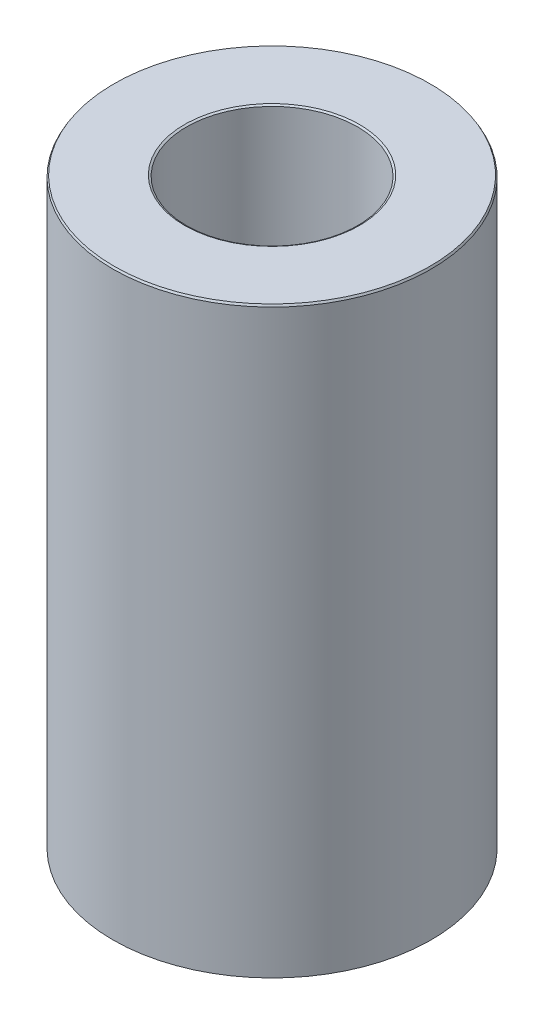
ISO-10303-21;
HEADER;
FILE_DESCRIPTION(('STEP AP214'),'2;1');
FILE_NAME('part.step','',(''),(''),'','','');
FILE_SCHEMA(('AUTOMOTIVE_DESIGN { 1 0 10303 214 1 1 1 1 }'));
ENDSEC;
DATA;
#1=APPLICATION_CONTEXT('core data for automotive mechanical design processes');
#2=APPLICATION_PROTOCOL_DEFINITION('international standard','automotive_design',2000,#1);
#3=PRODUCT_CONTEXT('',#1,'mechanical');
#4=PRODUCT('Part','Part','',(#3));
#5=PRODUCT_RELATED_PRODUCT_CATEGORY('part','',(#4));
#6=PRODUCT_DEFINITION_FORMATION('','',#4);
#7=PRODUCT_DEFINITION_CONTEXT('part definition',#1,'design');
#8=PRODUCT_DEFINITION('design','',#6,#7);
#9=PRODUCT_DEFINITION_SHAPE('','',#8);
#10=(LENGTH_UNIT() NAMED_UNIT(*) SI_UNIT(.MILLI.,.METRE.));
#11=(NAMED_UNIT(*) PLANE_ANGLE_UNIT() SI_UNIT($,.RADIAN.));
#12=(NAMED_UNIT(*) SI_UNIT($,.STERADIAN.) SOLID_ANGLE_UNIT());
#13=UNCERTAINTY_MEASURE_WITH_UNIT(LENGTH_MEASURE(1.E-05),#10,'distance_accuracy_value','');
#14=(GEOMETRIC_REPRESENTATION_CONTEXT(3) GLOBAL_UNCERTAINTY_ASSIGNED_CONTEXT((#13)) GLOBAL_UNIT_ASSIGNED_CONTEXT((#10,
#11,#12)) REPRESENTATION_CONTEXT('',''));
#15=CARTESIAN_POINT('',(0.,0.,0.));
#16=DIRECTION('',(0.,0.,1.));
#17=DIRECTION('',(1.,0.,0.));
#18=AXIS2_PLACEMENT_3D('',#15,#16,#17);
#19=CARTESIAN_POINT('',(0.,192.65912869605,0.));
#20=DIRECTION('',(0.,-1.,0.));
#21=DIRECTION('',(0.,0.,-1.));
#22=AXIS2_PLACEMENT_3D('',#19,#20,#21);
#23=CYLINDRICAL_SURFACE('',#22,52.5);
#24=CARTESIAN_POINT('',(0.,0.365443139363902,0.));
#25=DIRECTION('',(0.,1.,0.));
#26=DIRECTION('',(0.,0.,1.));
#27=AXIS2_PLACEMENT_3D('',#24,#25,#26);
#28=CIRCLE('',#27,52.5);
#29=CARTESIAN_POINT('',(0.,0.365443139363902,52.5));
#30=VERTEX_POINT('',#29);
#31=EDGE_CURVE('E10',#30,#30,#28,.T.);
#32=ORIENTED_EDGE('',*,*,#31,.T.);
#33=EDGE_LOOP('',(#32));
#34=FACE_BOUND('',#33,.T.);
#35=CARTESIAN_POINT('',(0.,192.026162611394,0.));
#36=DIRECTION('',(0.,1.,0.));
#37=DIRECTION('',(0.,0.,1.));
#38=AXIS2_PLACEMENT_3D('',#35,#36,#37);
#39=CIRCLE('',#38,52.5);
#40=CARTESIAN_POINT('',(0.,192.026162611394,52.5));
#41=VERTEX_POINT('',#40);
#42=EDGE_CURVE('E50',#41,#41,#39,.F.);
#43=ORIENTED_EDGE('',*,*,#42,.T.);
#44=EDGE_LOOP('',(#43));
#45=FACE_BOUND('',#44,.T.);
#46=ADVANCED_FACE('F39',(#34,#45),#23,.T.);
#47=CARTESIAN_POINT('',(0.,192.65912869605,0.));
#48=DIRECTION('',(0.,1.,0.));
#49=DIRECTION('',(0.,0.,1.));
#50=AXIS2_PLACEMENT_3D('',#47,#48,#49);
#51=PLANE('',#50);
#52=CARTESIAN_POINT('',(0.,192.65912869605,0.));
#53=DIRECTION('',(0.,1.,0.));
#54=DIRECTION('',(0.,0.,1.));
#55=AXIS2_PLACEMENT_3D('',#52,#53,#54);
#56=CIRCLE('',#55,28.862881946732);
#57=CARTESIAN_POINT('',(0.,192.65912869605,28.862881946732));
#58=VERTEX_POINT('',#57);
#59=EDGE_CURVE('E58',#58,#58,#56,.F.);
#60=ORIENTED_EDGE('',*,*,#59,.T.);
#61=EDGE_LOOP('',(#60));
#62=FACE_BOUND('',#61,.T.);
#63=CARTESIAN_POINT('',(0.,192.65912869605,0.));
#64=DIRECTION('',(0.,1.,0.));
#65=DIRECTION('',(0.,0.,1.));
#66=AXIS2_PLACEMENT_3D('',#63,#64,#65);
#67=CIRCLE('',#66,52.1345568606361);
#68=CARTESIAN_POINT('',(0.,192.65912869605,52.1345568606361));
#69=VERTEX_POINT('',#68);
#70=EDGE_CURVE('E61',#69,#69,#67,.T.);
#71=ORIENTED_EDGE('',*,*,#70,.T.);
#72=EDGE_LOOP('',(#71));
#73=FACE_BOUND('',#72,.T.);
#74=ADVANCED_FACE('F88',(#62,#73),#51,.T.);
#75=CARTESIAN_POINT('',(0.,0.,0.));
#76=DIRECTION('',(0.,1.,0.));
#77=DIRECTION('',(0.,0.,1.));
#78=AXIS2_PLACEMENT_3D('',#75,#76,#77);
#79=PLANE('',#78);
#80=CARTESIAN_POINT('',(0.,0.,0.));
#81=DIRECTION('',(0.,1.,0.));
#82=DIRECTION('',(0.,0.,1.));
#83=AXIS2_PLACEMENT_3D('',#80,#81,#82);
#84=CIRCLE('',#83,28.5953590014403);
#85=CARTESIAN_POINT('',(0.,0.,28.5953590014403));
#86=VERTEX_POINT('',#85);
#87=EDGE_CURVE('E51',#86,#86,#84,.T.);
#88=ORIENTED_EDGE('',*,*,#87,.T.);
#89=EDGE_LOOP('',(#88));
#90=FACE_BOUND('',#89,.T.);
#91=CARTESIAN_POINT('',(0.,0.,0.));
#92=DIRECTION('',(0.,1.,0.));
#93=DIRECTION('',(0.,0.,1.));
#94=AXIS2_PLACEMENT_3D('',#91,#92,#93);
#95=CIRCLE('',#94,51.8670339153443);
#96=CARTESIAN_POINT('',(0.,0.,51.8670339153443));
#97=VERTEX_POINT('',#96);
#98=EDGE_CURVE('E54',#97,#97,#95,.F.);
#99=ORIENTED_EDGE('',*,*,#98,.T.);
#100=EDGE_LOOP('',(#99));
#101=FACE_BOUND('',#100,.T.);
#102=ADVANCED_FACE('F83',(#90,#101),#79,.F.);
#103=CARTESIAN_POINT('',(0.,192.65912869605,0.));
#104=DIRECTION('',(0.,-1.,0.));
#105=DIRECTION('',(0.,0.,-1.));
#106=AXIS2_PLACEMENT_3D('',#103,#104,#105);
#107=CYLINDRICAL_SURFACE('',#106,28.2299158620763);
#108=CARTESIAN_POINT('',(0.,192.293685556686,0.));
#109=DIRECTION('',(0.,1.,0.));
#110=DIRECTION('',(0.,0.,1.));
#111=AXIS2_PLACEMENT_3D('',#108,#109,#110);
#112=CIRCLE('',#111,28.2299158620763);
#113=CARTESIAN_POINT('',(0.,192.293685556686,28.2299158620763));
#114=VERTEX_POINT('',#113);
#115=EDGE_CURVE('E67',#114,#114,#112,.T.);
#116=ORIENTED_EDGE('',*,*,#115,.T.);
#117=EDGE_LOOP('',(#116));
#118=FACE_BOUND('',#117,.T.);
#119=CARTESIAN_POINT('',(0.,0.632966084655795,0.));
#120=DIRECTION('',(0.,1.,0.));
#121=DIRECTION('',(0.,0.,1.));
#122=AXIS2_PLACEMENT_3D('',#119,#120,#121);
#123=CIRCLE('',#122,28.2299158620763);
#124=CARTESIAN_POINT('',(0.,0.632966084655795,28.2299158620763));
#125=VERTEX_POINT('',#124);
#126=EDGE_CURVE('E69',#125,#125,#123,.F.);
#127=ORIENTED_EDGE('',*,*,#126,.T.);
#128=EDGE_LOOP('',(#127));
#129=FACE_BOUND('',#128,.T.);
#130=ADVANCED_FACE('F71',(#118,#129),#107,.F.);
#131=CARTESIAN_POINT('',(0.,192.293685556686,0.));
#132=DIRECTION('',(0.,1.,0.));
#133=DIRECTION('',(0.,0.,1.));
#134=AXIS2_PLACEMENT_3D('',#131,#132,#133);
#135=CONICAL_SURFACE('',#134,28.2299158620763,1.04719755119661);
#136=ORIENTED_EDGE('',*,*,#59,.F.);
#137=EDGE_LOOP('',(#136));
#138=FACE_BOUND('',#137,.T.);
#139=ORIENTED_EDGE('',*,*,#115,.F.);
#140=EDGE_LOOP('',(#139));
#141=FACE_BOUND('',#140,.T.);
#142=ADVANCED_FACE('F77',(#138,#141),#135,.F.);
#143=CARTESIAN_POINT('',(0.,0.,0.));
#144=DIRECTION('',(0.,-1.,0.));
#145=DIRECTION('',(0.,0.,-1.));
#146=AXIS2_PLACEMENT_3D('',#143,#144,#145);
#147=CONICAL_SURFACE('',#146,28.5953590014403,0.523598775598311);
#148=ORIENTED_EDGE('',*,*,#126,.F.);
#149=EDGE_LOOP('',(#148));
#150=FACE_BOUND('',#149,.T.);
#151=ORIENTED_EDGE('',*,*,#87,.F.);
#152=EDGE_LOOP('',(#151));
#153=FACE_BOUND('',#152,.T.);
#154=ADVANCED_FACE('F73',(#150,#153),#147,.F.);
#155=CARTESIAN_POINT('',(0.,0.365443139363902,0.));
#156=DIRECTION('',(0.,1.,0.));
#157=DIRECTION('',(0.,0.,1.));
#158=AXIS2_PLACEMENT_3D('',#155,#156,#157);
#159=CONICAL_SURFACE('',#158,52.5,1.04719755119659);
#160=ORIENTED_EDGE('',*,*,#98,.F.);
#161=EDGE_LOOP('',(#160));
#162=FACE_BOUND('',#161,.T.);
#163=ORIENTED_EDGE('',*,*,#31,.F.);
#164=EDGE_LOOP('',(#163));
#165=FACE_BOUND('',#164,.T.);
#166=ADVANCED_FACE('F76',(#162,#165),#159,.T.);
#167=CARTESIAN_POINT('',(0.,192.65912869605,0.));
#168=DIRECTION('',(0.,-1.,0.));
#169=DIRECTION('',(0.,0.,-1.));
#170=AXIS2_PLACEMENT_3D('',#167,#168,#169);
#171=CONICAL_SURFACE('',#170,52.1345568606361,0.523598775598278);
#172=ORIENTED_EDGE('',*,*,#42,.F.);
#173=EDGE_LOOP('',(#172));
#174=FACE_BOUND('',#173,.T.);
#175=ORIENTED_EDGE('',*,*,#70,.F.);
#176=EDGE_LOOP('',(#175));
#177=FACE_BOUND('',#176,.T.);
#178=ADVANCED_FACE('F45',(#174,#177),#171,.T.);
#179=CLOSED_SHELL('',(#46,#74,#102,#130,#142,#154,#166,#178));
#180=MANIFOLD_SOLID_BREP('B2',#179);
#181=ADVANCED_BREP_SHAPE_REPRESENTATION('',(#18,#180),#14);
#182=SHAPE_DEFINITION_REPRESENTATION(#9,#181);
ENDSEC;
END-ISO-10303-21;
